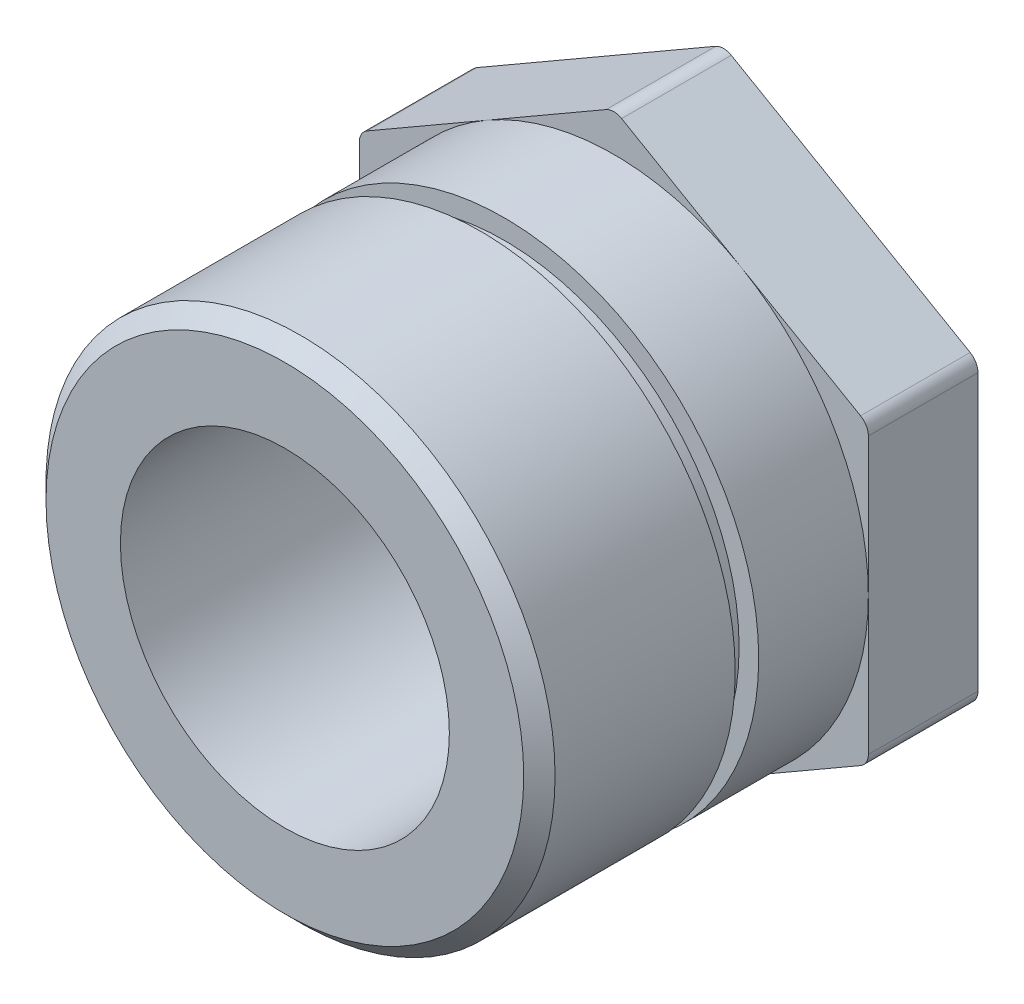
ISO-10303-21;
HEADER;
FILE_DESCRIPTION(('STEP AP214'),'2;1');
FILE_NAME('part.step','',(''),(''),'','','');
FILE_SCHEMA(('AUTOMOTIVE_DESIGN { 1 0 10303 214 1 1 1 1 }'));
ENDSEC;
DATA;
#1=APPLICATION_CONTEXT('core data for automotive mechanical design processes');
#2=APPLICATION_PROTOCOL_DEFINITION('international standard','automotive_design',2000,#1);
#3=PRODUCT_CONTEXT('',#1,'mechanical');
#4=PRODUCT('Part','Part','',(#3));
#5=PRODUCT_RELATED_PRODUCT_CATEGORY('part','',(#4));
#6=PRODUCT_DEFINITION_FORMATION('','',#4);
#7=PRODUCT_DEFINITION_CONTEXT('part definition',#1,'design');
#8=PRODUCT_DEFINITION('design','',#6,#7);
#9=PRODUCT_DEFINITION_SHAPE('','',#8);
#10=(LENGTH_UNIT() NAMED_UNIT(*) SI_UNIT(.MILLI.,.METRE.));
#11=(NAMED_UNIT(*) PLANE_ANGLE_UNIT() SI_UNIT($,.RADIAN.));
#12=(NAMED_UNIT(*) SI_UNIT($,.STERADIAN.) SOLID_ANGLE_UNIT());
#13=UNCERTAINTY_MEASURE_WITH_UNIT(LENGTH_MEASURE(1.E-05),#10,'distance_accuracy_value','');
#14=(GEOMETRIC_REPRESENTATION_CONTEXT(3) GLOBAL_UNCERTAINTY_ASSIGNED_CONTEXT((#13)) GLOBAL_UNIT_ASSIGNED_CONTEXT((#10,
#11,#12)) REPRESENTATION_CONTEXT('',''));
#15=CARTESIAN_POINT('',(0.,0.,0.));
#16=DIRECTION('',(0.,0.,1.));
#17=DIRECTION('',(1.,0.,0.));
#18=AXIS2_PLACEMENT_3D('',#15,#16,#17);
#19=CARTESIAN_POINT('',(0.,0.,42.));
#20=DIRECTION('',(0.,0.,-1.));
#21=DIRECTION('',(-1.,0.,0.));
#22=AXIS2_PLACEMENT_3D('',#19,#20,#21);
#23=CYLINDRICAL_SURFACE('',#22,32.5);
#24=CARTESIAN_POINT('',(0.,0.,40.0000000000001));
#25=DIRECTION('',(0.,0.,1.));
#26=DIRECTION('',(1.,0.,0.));
#27=AXIS2_PLACEMENT_3D('',#24,#25,#26);
#28=CIRCLE('',#27,32.5);
#29=CARTESIAN_POINT('',(32.5,0.,40.0000000000001));
#30=VERTEX_POINT('',#29);
#31=EDGE_CURVE('E11',#30,#30,#28,.F.);
#32=ORIENTED_EDGE('',*,*,#31,.T.);
#33=EDGE_LOOP('',(#32));
#34=FACE_BOUND('',#33,.T.);
#35=CARTESIAN_POINT('',(0.,0.,17.));
#36=DIRECTION('',(0.,0.,1.));
#37=DIRECTION('',(1.,0.,0.));
#38=AXIS2_PLACEMENT_3D('',#35,#36,#37);
#39=CIRCLE('',#38,32.5);
#40=CARTESIAN_POINT('',(32.5,0.,17.));
#41=VERTEX_POINT('',#40);
#42=EDGE_CURVE('E343',#41,#41,#39,.T.);
#43=ORIENTED_EDGE('',*,*,#42,.T.);
#44=EDGE_LOOP('',(#43));
#45=FACE_BOUND('',#44,.T.);
#46=ADVANCED_FACE('F51',(#34,#45),#23,.T.);
#47=CARTESIAN_POINT('',(0.,0.,42.));
#48=DIRECTION('',(0.,0.,1.));
#49=DIRECTION('',(1.,0.,0.));
#50=AXIS2_PLACEMENT_3D('',#47,#48,#49);
#51=PLANE('',#50);
#52=CARTESIAN_POINT('',(0.,0.,42.));
#53=DIRECTION('',(0.,0.,1.));
#54=DIRECTION('',(1.,0.,0.));
#55=AXIS2_PLACEMENT_3D('',#52,#53,#54);
#56=CIRCLE('',#55,21.);
#57=CARTESIAN_POINT('',(21.,0.,42.));
#58=VERTEX_POINT('',#57);
#59=EDGE_CURVE('E403',#58,#58,#56,.T.);
#60=ORIENTED_EDGE('',*,*,#59,.F.);
#61=EDGE_LOOP('',(#60));
#62=FACE_BOUND('',#61,.T.);
#63=CARTESIAN_POINT('',(0.,0.,42.));
#64=DIRECTION('',(0.,0.,1.));
#65=DIRECTION('',(1.,0.,0.));
#66=AXIS2_PLACEMENT_3D('',#63,#64,#65);
#67=CIRCLE('',#66,30.5000000000001);
#68=CARTESIAN_POINT('',(30.5000000000001,0.,42.));
#69=VERTEX_POINT('',#68);
#70=EDGE_CURVE('E61',#69,#69,#67,.T.);
#71=ORIENTED_EDGE('',*,*,#70,.T.);
#72=EDGE_LOOP('',(#71));
#73=FACE_BOUND('',#72,.T.);
#74=ADVANCED_FACE('F286',(#62,#73),#51,.T.);
#75=CARTESIAN_POINT('',(0.,0.,17.));
#76=DIRECTION('',(0.,0.,1.));
#77=DIRECTION('',(1.,0.,0.));
#78=AXIS2_PLACEMENT_3D('',#75,#76,#77);
#79=PLANE('',#78);
#80=ORIENTED_EDGE('',*,*,#42,.F.);
#81=EDGE_LOOP('',(#80));
#82=FACE_BOUND('',#81,.T.);
#83=CARTESIAN_POINT('',(0.,0.,17.));
#84=DIRECTION('',(0.,0.,1.));
#85=DIRECTION('',(1.,0.,0.));
#86=AXIS2_PLACEMENT_3D('',#83,#84,#85);
#87=CIRCLE('',#86,30.);
#88=CARTESIAN_POINT('',(30.,0.,17.));
#89=VERTEX_POINT('',#88);
#90=EDGE_CURVE('E345',#89,#89,#87,.T.);
#91=ORIENTED_EDGE('',*,*,#90,.T.);
#92=EDGE_LOOP('',(#91));
#93=FACE_BOUND('',#92,.T.);
#94=ADVANCED_FACE('F307',(#82,#93),#79,.F.);
#95=CARTESIAN_POINT('',(0.,0.,14.));
#96=DIRECTION('',(0.,0.,1.));
#97=DIRECTION('',(1.,0.,0.));
#98=AXIS2_PLACEMENT_3D('',#95,#96,#97);
#99=PLANE('',#98);
#100=CARTESIAN_POINT('',(0.,0.,14.));
#101=DIRECTION('',(0.,0.,1.));
#102=DIRECTION('',(1.,0.,0.));
#103=AXIS2_PLACEMENT_3D('',#100,#101,#102);
#104=CIRCLE('',#103,32.5);
#105=CARTESIAN_POINT('',(32.5,0.,14.));
#106=VERTEX_POINT('',#105);
#107=EDGE_CURVE('E209',#106,#106,#104,.T.);
#108=ORIENTED_EDGE('',*,*,#107,.T.);
#109=EDGE_LOOP('',(#108));
#110=FACE_BOUND('',#109,.T.);
#111=CARTESIAN_POINT('',(0.,0.,14.));
#112=DIRECTION('',(0.,0.,1.));
#113=DIRECTION('',(1.,0.,0.));
#114=AXIS2_PLACEMENT_3D('',#111,#112,#113);
#115=CIRCLE('',#114,30.);
#116=CARTESIAN_POINT('',(30.,0.,14.));
#117=VERTEX_POINT('',#116);
#118=EDGE_CURVE('E347',#117,#117,#115,.T.);
#119=ORIENTED_EDGE('',*,*,#118,.F.);
#120=EDGE_LOOP('',(#119));
#121=FACE_BOUND('',#120,.T.);
#122=ADVANCED_FACE('F323',(#110,#121),#99,.T.);
#123=CARTESIAN_POINT('',(0.,0.,17.));
#124=DIRECTION('',(0.,0.,-1.));
#125=DIRECTION('',(-1.,0.,0.));
#126=AXIS2_PLACEMENT_3D('',#123,#124,#125);
#127=CYLINDRICAL_SURFACE('',#126,30.);
#128=ORIENTED_EDGE('',*,*,#90,.F.);
#129=EDGE_LOOP('',(#128));
#130=FACE_BOUND('',#129,.T.);
#131=ORIENTED_EDGE('',*,*,#118,.T.);
#132=EDGE_LOOP('',(#131));
#133=FACE_BOUND('',#132,.T.);
#134=ADVANCED_FACE('F314',(#130,#133),#127,.T.);
#135=CARTESIAN_POINT('',(0.,0.,0.));
#136=DIRECTION('',(0.,0.,1.));
#137=DIRECTION('',(1.,0.,0.));
#138=AXIS2_PLACEMENT_3D('',#135,#136,#137);
#139=CIRCLE('',#138,32.5);
#140=CARTESIAN_POINT('',(32.5,0.,0.));
#141=VERTEX_POINT('',#140);
#142=CARTESIAN_POINT('',(16.25,28.1458256229943,0.));
#143=VERTEX_POINT('',#142);
#144=EDGE_CURVE('E204',#141,#143,#139,.T.);
#145=ORIENTED_EDGE('',*,*,#144,.T.);
#146=CARTESIAN_POINT('',(-16.25,28.1458256229943,0.));
#147=VERTEX_POINT('',#146);
#148=EDGE_CURVE('E203',#143,#147,#139,.T.);
#149=ORIENTED_EDGE('',*,*,#148,.T.);
#150=CARTESIAN_POINT('',(-32.5,0.,0.));
#151=VERTEX_POINT('',#150);
#152=EDGE_CURVE('E200',#147,#151,#139,.T.);
#153=ORIENTED_EDGE('',*,*,#152,.T.);
#154=CARTESIAN_POINT('',(-16.25,-28.1458256229943,0.));
#155=VERTEX_POINT('',#154);
#156=EDGE_CURVE('E185',#151,#155,#139,.T.);
#157=ORIENTED_EDGE('',*,*,#156,.T.);
#158=CARTESIAN_POINT('',(16.25,-28.1458256229943,0.));
#159=VERTEX_POINT('',#158);
#160=EDGE_CURVE('E177',#155,#159,#139,.T.);
#161=ORIENTED_EDGE('',*,*,#160,.T.);
#162=EDGE_CURVE('E186',#159,#141,#139,.T.);
#163=ORIENTED_EDGE('',*,*,#162,.T.);
#164=EDGE_LOOP('',(#145,#149,#153,#157,#161,#163));
#165=FACE_BOUND('',#164,.T.);
#166=ORIENTED_EDGE('',*,*,#107,.F.);
#167=EDGE_LOOP('',(#166));
#168=FACE_BOUND('',#167,.T.);
#169=ADVANCED_FACE('F196',(#165,#168),#23,.T.);
#170=CARTESIAN_POINT('',(0.,0.,0.));
#171=DIRECTION('',(0.,0.,-1.));
#172=DIRECTION('',(-1.,0.,0.));
#173=AXIS2_PLACEMENT_3D('',#170,#171,#172);
#174=PLANE('',#173);
#175=DIRECTION('',(0.,-1.,0.));
#176=VECTOR('',#175,1.);
#177=CARTESIAN_POINT('',(32.5,18.7638837486629,0.));
#178=LINE('',#177,#176);
#179=CARTESIAN_POINT('',(32.5,17.6091832102836,0.));
#180=VERTEX_POINT('',#179);
#181=EDGE_CURVE('E370',#180,#141,#178,.T.);
#182=ORIENTED_EDGE('',*,*,#181,.F.);
#183=CARTESIAN_POINT('',(30.5,17.6091832102836,0.));
#184=DIRECTION('',(0.,0.,-1.));
#185=DIRECTION('',(-1.,0.,0.));
#186=AXIS2_PLACEMENT_3D('',#183,#184,#185);
#187=CIRCLE('',#186,2.);
#188=CARTESIAN_POINT('',(31.5,19.3412340178525,0.));
#189=VERTEX_POINT('',#188);
#190=EDGE_CURVE('E253',#180,#189,#187,.F.);
#191=ORIENTED_EDGE('',*,*,#190,.T.);
#192=DIRECTION('',(0.866025403784439,-0.5,0.));
#193=VECTOR('',#192,1.);
#194=CARTESIAN_POINT('',(0.,37.5277674973257,0.));
#195=LINE('',#194,#193);
#196=EDGE_CURVE('E375',#143,#189,#195,.T.);
#197=ORIENTED_EDGE('',*,*,#196,.F.);
#198=ORIENTED_EDGE('',*,*,#144,.F.);
#199=EDGE_LOOP('',(#182,#191,#197,#198));
#200=FACE_BOUND('',#199,.T.);
#201=ADVANCED_FACE('F313',(#200),#174,.F.);
#202=CARTESIAN_POINT('',(1.00000000000001,36.9504172281361,0.));
#203=VERTEX_POINT('',#202);
#204=EDGE_CURVE('E371',#203,#143,#195,.T.);
#205=ORIENTED_EDGE('',*,*,#204,.F.);
#206=CARTESIAN_POINT('',(0.,35.2183664205672,0.));
#207=DIRECTION('',(0.,0.,-1.));
#208=DIRECTION('',(-1.,0.,0.));
#209=AXIS2_PLACEMENT_3D('',#206,#207,#208);
#210=CIRCLE('',#209,2.);
#211=CARTESIAN_POINT('',(-1.,36.9504172281361,0.));
#212=VERTEX_POINT('',#211);
#213=EDGE_CURVE('E280',#203,#212,#210,.F.);
#214=ORIENTED_EDGE('',*,*,#213,.T.);
#215=DIRECTION('',(0.866025403784439,0.5,0.));
#216=VECTOR('',#215,1.);
#217=CARTESIAN_POINT('',(-32.5,18.7638837486628,0.));
#218=LINE('',#217,#216);
#219=EDGE_CURVE('E383',#147,#212,#218,.T.);
#220=ORIENTED_EDGE('',*,*,#219,.F.);
#221=ORIENTED_EDGE('',*,*,#148,.F.);
#222=EDGE_LOOP('',(#205,#214,#220,#221));
#223=FACE_BOUND('',#222,.T.);
#224=ADVANCED_FACE('F319',(#223),#174,.F.);
#225=CARTESIAN_POINT('',(-31.5,19.3412340178525,0.));
#226=VERTEX_POINT('',#225);
#227=EDGE_CURVE('E379',#226,#147,#218,.T.);
#228=ORIENTED_EDGE('',*,*,#227,.F.);
#229=CARTESIAN_POINT('',(-30.5,17.6091832102836,0.));
#230=DIRECTION('',(0.,0.,-1.));
#231=DIRECTION('',(-1.,0.,0.));
#232=AXIS2_PLACEMENT_3D('',#229,#230,#231);
#233=CIRCLE('',#232,2.);
#234=CARTESIAN_POINT('',(-32.5,17.6091832102836,0.));
#235=VERTEX_POINT('',#234);
#236=EDGE_CURVE('E76',#226,#235,#233,.F.);
#237=ORIENTED_EDGE('',*,*,#236,.T.);
#238=DIRECTION('',(0.,1.,0.));
#239=VECTOR('',#238,1.);
#240=CARTESIAN_POINT('',(-32.5,-18.7638837486628,0.));
#241=LINE('',#240,#239);
#242=EDGE_CURVE('E173',#151,#235,#241,.T.);
#243=ORIENTED_EDGE('',*,*,#242,.F.);
#244=ORIENTED_EDGE('',*,*,#152,.F.);
#245=EDGE_LOOP('',(#228,#237,#243,#244));
#246=FACE_BOUND('',#245,.T.);
#247=ADVANCED_FACE('F483',(#246),#174,.F.);
#248=CARTESIAN_POINT('',(-32.5,-17.6091832102836,0.));
#249=VERTEX_POINT('',#248);
#250=EDGE_CURVE('E419',#249,#151,#241,.T.);
#251=ORIENTED_EDGE('',*,*,#250,.F.);
#252=CARTESIAN_POINT('',(-30.5,-17.6091832102836,0.));
#253=DIRECTION('',(0.,0.,-1.));
#254=DIRECTION('',(-1.,0.,0.));
#255=AXIS2_PLACEMENT_3D('',#252,#253,#254);
#256=CIRCLE('',#255,2.);
#257=CARTESIAN_POINT('',(-31.5,-19.3412340178525,0.));
#258=VERTEX_POINT('',#257);
#259=EDGE_CURVE('E68',#249,#258,#256,.F.);
#260=ORIENTED_EDGE('',*,*,#259,.T.);
#261=DIRECTION('',(-0.866025403784439,0.5,0.));
#262=VECTOR('',#261,1.);
#263=CARTESIAN_POINT('',(0.,-37.5277674973257,0.));
#264=LINE('',#263,#262);
#265=EDGE_CURVE('E168',#155,#258,#264,.T.);
#266=ORIENTED_EDGE('',*,*,#265,.F.);
#267=ORIENTED_EDGE('',*,*,#156,.F.);
#268=EDGE_LOOP('',(#251,#260,#266,#267));
#269=FACE_BOUND('',#268,.T.);
#270=ADVANCED_FACE('F191',(#269),#174,.F.);
#271=CARTESIAN_POINT('',(-1.,-36.9504172281361,0.));
#272=VERTEX_POINT('',#271);
#273=EDGE_CURVE('E163',#272,#155,#264,.T.);
#274=ORIENTED_EDGE('',*,*,#273,.F.);
#275=CARTESIAN_POINT('',(0.,-35.2183664205672,0.));
#276=DIRECTION('',(0.,0.,-1.));
#277=DIRECTION('',(-1.,0.,0.));
#278=AXIS2_PLACEMENT_3D('',#275,#276,#277);
#279=CIRCLE('',#278,2.);
#280=CARTESIAN_POINT('',(1.,-36.9504172281361,0.));
#281=VERTEX_POINT('',#280);
#282=EDGE_CURVE('E215',#272,#281,#279,.F.);
#283=ORIENTED_EDGE('',*,*,#282,.T.);
#284=DIRECTION('',(-0.866025403784439,-0.5,0.));
#285=VECTOR('',#284,1.);
#286=CARTESIAN_POINT('',(32.5,-18.7638837486628,0.));
#287=LINE('',#286,#285);
#288=EDGE_CURVE('E180',#159,#281,#287,.T.);
#289=ORIENTED_EDGE('',*,*,#288,.F.);
#290=ORIENTED_EDGE('',*,*,#160,.F.);
#291=EDGE_LOOP('',(#274,#283,#289,#290));
#292=FACE_BOUND('',#291,.T.);
#293=ADVANCED_FACE('F178',(#292),#174,.F.);
#294=CARTESIAN_POINT('',(0.,-37.5277674973257,-14.));
#295=DIRECTION('',(0.5,0.866025403784439,0.));
#296=DIRECTION('',(-0.866025403784439,0.5,0.));
#297=AXIS2_PLACEMENT_3D('',#294,#295,#296);
#298=PLANE('',#297);
#299=DIRECTION('',(-0.866025403784439,0.5,0.));
#300=VECTOR('',#299,1.);
#301=CARTESIAN_POINT('',(0.,-37.5277674973257,-14.));
#302=LINE('',#301,#300);
#303=CARTESIAN_POINT('',(-1.,-36.9504172281361,-14.));
#304=VERTEX_POINT('',#303);
#305=CARTESIAN_POINT('',(-31.5,-19.3412340178525,-14.));
#306=VERTEX_POINT('',#305);
#307=EDGE_CURVE('E391',#304,#306,#302,.T.);
#308=ORIENTED_EDGE('',*,*,#307,.F.);
#309=DIRECTION('',(0.,0.,1.));
#310=VECTOR('',#309,1.);
#311=CARTESIAN_POINT('',(-1.,-36.9504172281361,-14.));
#312=LINE('',#311,#310);
#313=EDGE_CURVE('E170',#304,#272,#312,.T.);
#314=ORIENTED_EDGE('',*,*,#313,.T.);
#315=ORIENTED_EDGE('',*,*,#273,.T.);
#316=ORIENTED_EDGE('',*,*,#265,.T.);
#317=DIRECTION('',(0.,0.,1.));
#318=VECTOR('',#317,1.);
#319=CARTESIAN_POINT('',(-31.5,-19.3412340178525,-14.));
#320=LINE('',#319,#318);
#321=EDGE_CURVE('E208',#258,#306,#320,.F.);
#322=ORIENTED_EDGE('',*,*,#321,.T.);
#323=EDGE_LOOP('',(#308,#314,#315,#316,#322));
#324=FACE_BOUND('',#323,.T.);
#325=ADVANCED_FACE('F166',(#324),#298,.F.);
#326=CARTESIAN_POINT('',(-32.5,-18.7638837486628,-14.));
#327=DIRECTION('',(1.,0.,0.));
#328=DIRECTION('',(0.,1.,0.));
#329=AXIS2_PLACEMENT_3D('',#326,#327,#328);
#330=PLANE('',#329);
#331=ORIENTED_EDGE('',*,*,#242,.T.);
#332=DIRECTION('',(0.,0.,1.));
#333=VECTOR('',#332,1.);
#334=CARTESIAN_POINT('',(-32.5,17.6091832102836,-14.));
#335=LINE('',#334,#333);
#336=CARTESIAN_POINT('',(-32.5,17.6091832102836,-14.));
#337=VERTEX_POINT('',#336);
#338=EDGE_CURVE('E275',#235,#337,#335,.F.);
#339=ORIENTED_EDGE('',*,*,#338,.T.);
#340=DIRECTION('',(0.,1.,0.));
#341=VECTOR('',#340,1.);
#342=CARTESIAN_POINT('',(-32.5,-18.7638837486628,-14.));
#343=LINE('',#342,#341);
#344=CARTESIAN_POINT('',(-32.5,-17.6091832102836,-14.));
#345=VERTEX_POINT('',#344);
#346=EDGE_CURVE('E394',#345,#337,#343,.T.);
#347=ORIENTED_EDGE('',*,*,#346,.F.);
#348=DIRECTION('',(0.,0.,1.));
#349=VECTOR('',#348,1.);
#350=CARTESIAN_POINT('',(-32.5,-17.6091832102836,-14.));
#351=LINE('',#350,#349);
#352=EDGE_CURVE('E272',#345,#249,#351,.T.);
#353=ORIENTED_EDGE('',*,*,#352,.T.);
#354=ORIENTED_EDGE('',*,*,#250,.T.);
#355=EDGE_LOOP('',(#331,#339,#347,#353,#354));
#356=FACE_BOUND('',#355,.T.);
#357=ADVANCED_FACE('F426',(#356),#330,.F.);
#358=CARTESIAN_POINT('',(-32.5,18.7638837486628,-14.));
#359=DIRECTION('',(0.5,-0.866025403784439,0.));
#360=DIRECTION('',(0.866025403784439,0.5,0.));
#361=AXIS2_PLACEMENT_3D('',#358,#359,#360);
#362=PLANE('',#361);
#363=DIRECTION('',(0.866025403784439,0.5,0.));
#364=VECTOR('',#363,1.);
#365=CARTESIAN_POINT('',(-32.5,18.7638837486628,-14.));
#366=LINE('',#365,#364);
#367=CARTESIAN_POINT('',(-31.5,19.3412340178525,-14.));
#368=VERTEX_POINT('',#367);
#369=CARTESIAN_POINT('',(-1.,36.9504172281361,-14.));
#370=VERTEX_POINT('',#369);
#371=EDGE_CURVE('E400',#368,#370,#366,.T.);
#372=ORIENTED_EDGE('',*,*,#371,.F.);
#373=DIRECTION('',(0.,0.,1.));
#374=VECTOR('',#373,1.);
#375=CARTESIAN_POINT('',(-31.5,19.3412340178525,-14.));
#376=LINE('',#375,#374);
#377=EDGE_CURVE('E266',#368,#226,#376,.T.);
#378=ORIENTED_EDGE('',*,*,#377,.T.);
#379=ORIENTED_EDGE('',*,*,#227,.T.);
#380=ORIENTED_EDGE('',*,*,#219,.T.);
#381=DIRECTION('',(0.,0.,1.));
#382=VECTOR('',#381,1.);
#383=CARTESIAN_POINT('',(-0.999999999999987,36.9504172281361,-14.));
#384=LINE('',#383,#382);
#385=EDGE_CURVE('E263',#212,#370,#384,.F.);
#386=ORIENTED_EDGE('',*,*,#385,.T.);
#387=EDGE_LOOP('',(#372,#378,#379,#380,#386));
#388=FACE_BOUND('',#387,.T.);
#389=ADVANCED_FACE('F436',(#388),#362,.F.);
#390=CARTESIAN_POINT('',(0.,37.5277674973257,-14.));
#391=DIRECTION('',(-0.5,-0.866025403784439,0.));
#392=DIRECTION('',(0.866025403784439,-0.5,0.));
#393=AXIS2_PLACEMENT_3D('',#390,#391,#392);
#394=PLANE('',#393);
#395=ORIENTED_EDGE('',*,*,#196,.T.);
#396=DIRECTION('',(0.,0.,1.));
#397=VECTOR('',#396,1.);
#398=CARTESIAN_POINT('',(31.5,19.3412340178525,-14.));
#399=LINE('',#398,#397);
#400=CARTESIAN_POINT('',(31.5,19.3412340178525,-14.));
#401=VERTEX_POINT('',#400);
#402=EDGE_CURVE('E260',#189,#401,#399,.F.);
#403=ORIENTED_EDGE('',*,*,#402,.T.);
#404=DIRECTION('',(0.866025403784439,-0.5,0.));
#405=VECTOR('',#404,1.);
#406=CARTESIAN_POINT('',(0.,37.5277674973257,-14.));
#407=LINE('',#406,#405);
#408=CARTESIAN_POINT('',(1.00000000000001,36.9504172281361,-14.));
#409=VERTEX_POINT('',#408);
#410=EDGE_CURVE('E409',#409,#401,#407,.T.);
#411=ORIENTED_EDGE('',*,*,#410,.F.);
#412=DIRECTION('',(0.,0.,1.));
#413=VECTOR('',#412,1.);
#414=CARTESIAN_POINT('',(1.00000000000001,36.9504172281361,-14.));
#415=LINE('',#414,#413);
#416=EDGE_CURVE('E256',#409,#203,#415,.T.);
#417=ORIENTED_EDGE('',*,*,#416,.T.);
#418=ORIENTED_EDGE('',*,*,#204,.T.);
#419=EDGE_LOOP('',(#395,#403,#411,#417,#418));
#420=FACE_BOUND('',#419,.T.);
#421=ADVANCED_FACE('F442',(#420),#394,.F.);
#422=CARTESIAN_POINT('',(32.5,18.7638837486629,-14.));
#423=DIRECTION('',(-1.,0.,0.));
#424=DIRECTION('',(0.,0.,1.));
#425=AXIS2_PLACEMENT_3D('',#422,#423,#424);
#426=PLANE('',#425);
#427=CARTESIAN_POINT('',(32.5,-17.6091832102836,0.));
#428=VERTEX_POINT('',#427);
#429=EDGE_CURVE('E366',#141,#428,#178,.T.);
#430=ORIENTED_EDGE('',*,*,#429,.T.);
#431=DIRECTION('',(0.,0.,1.));
#432=VECTOR('',#431,1.);
#433=CARTESIAN_POINT('',(32.5,-17.6091832102836,-14.));
#434=LINE('',#433,#432);
#435=CARTESIAN_POINT('',(32.5,-17.6091832102836,-14.));
#436=VERTEX_POINT('',#435);
#437=EDGE_CURVE('E250',#428,#436,#434,.F.);
#438=ORIENTED_EDGE('',*,*,#437,.T.);
#439=DIRECTION('',(0.,-1.,0.));
#440=VECTOR('',#439,1.);
#441=CARTESIAN_POINT('',(32.5,18.7638837486629,-14.));
#442=LINE('',#441,#440);
#443=CARTESIAN_POINT('',(32.5,17.6091832102836,-14.));
#444=VERTEX_POINT('',#443);
#445=EDGE_CURVE('E413',#444,#436,#442,.T.);
#446=ORIENTED_EDGE('',*,*,#445,.F.);
#447=DIRECTION('',(0.,0.,1.));
#448=VECTOR('',#447,1.);
#449=CARTESIAN_POINT('',(32.5,17.6091832102836,-14.));
#450=LINE('',#449,#448);
#451=EDGE_CURVE('E246',#444,#180,#450,.T.);
#452=ORIENTED_EDGE('',*,*,#451,.T.);
#453=ORIENTED_EDGE('',*,*,#181,.T.);
#454=EDGE_LOOP('',(#430,#438,#446,#452,#453));
#455=FACE_BOUND('',#454,.T.);
#456=ADVANCED_FACE('F449',(#455),#426,.F.);
#457=CARTESIAN_POINT('',(32.5,-18.7638837486628,-14.));
#458=DIRECTION('',(-0.5,0.866025403784439,0.));
#459=DIRECTION('',(-0.866025403784439,-0.5,0.));
#460=AXIS2_PLACEMENT_3D('',#457,#458,#459);
#461=PLANE('',#460);
#462=ORIENTED_EDGE('',*,*,#288,.T.);
#463=DIRECTION('',(0.,0.,1.));
#464=VECTOR('',#463,1.);
#465=CARTESIAN_POINT('',(1.,-36.9504172281361,-14.));
#466=LINE('',#465,#464);
#467=CARTESIAN_POINT('',(1.,-36.9504172281361,-14.));
#468=VERTEX_POINT('',#467);
#469=EDGE_CURVE('E222',#281,#468,#466,.F.);
#470=ORIENTED_EDGE('',*,*,#469,.T.);
#471=DIRECTION('',(-0.866025403784439,-0.5,0.));
#472=VECTOR('',#471,1.);
#473=CARTESIAN_POINT('',(32.5,-18.7638837486628,-14.));
#474=LINE('',#473,#472);
#475=CARTESIAN_POINT('',(31.5,-19.3412340178525,-14.));
#476=VERTEX_POINT('',#475);
#477=EDGE_CURVE('E353',#476,#468,#474,.T.);
#478=ORIENTED_EDGE('',*,*,#477,.F.);
#479=DIRECTION('',(0.,0.,1.));
#480=VECTOR('',#479,1.);
#481=CARTESIAN_POINT('',(31.5,-19.3412340178525,-14.));
#482=LINE('',#481,#480);
#483=CARTESIAN_POINT('',(31.5,-19.3412340178525,0.));
#484=VERTEX_POINT('',#483);
#485=EDGE_CURVE('E218',#476,#484,#482,.T.);
#486=ORIENTED_EDGE('',*,*,#485,.T.);
#487=EDGE_CURVE('E356',#484,#159,#287,.T.);
#488=ORIENTED_EDGE('',*,*,#487,.T.);
#489=EDGE_LOOP('',(#462,#470,#478,#486,#488));
#490=FACE_BOUND('',#489,.T.);
#491=ADVANCED_FACE('F455',(#490),#461,.F.);
#492=CARTESIAN_POINT('',(0.,0.,-14.));
#493=DIRECTION('',(0.,0.,-1.));
#494=DIRECTION('',(-1.,0.,0.));
#495=AXIS2_PLACEMENT_3D('',#492,#493,#494);
#496=PLANE('',#495);
#497=CARTESIAN_POINT('',(0.,0.,-14.));
#498=DIRECTION('',(0.,0.,1.));
#499=DIRECTION('',(1.,0.,0.));
#500=AXIS2_PLACEMENT_3D('',#497,#498,#499);
#501=CIRCLE('',#500,21.);
#502=CARTESIAN_POINT('',(21.,0.,-14.));
#503=VERTEX_POINT('',#502);
#504=EDGE_CURVE('E193',#503,#503,#501,.T.);
#505=ORIENTED_EDGE('',*,*,#504,.T.);
#506=EDGE_LOOP('',(#505));
#507=FACE_BOUND('',#506,.T.);
#508=ORIENTED_EDGE('',*,*,#477,.T.);
#509=CARTESIAN_POINT('',(0.,-35.2183664205672,-14.));
#510=DIRECTION('',(0.,0.,-1.));
#511=DIRECTION('',(-1.,0.,0.));
#512=AXIS2_PLACEMENT_3D('',#509,#510,#511);
#513=CIRCLE('',#512,2.);
#514=EDGE_CURVE('E240',#468,#304,#513,.T.);
#515=ORIENTED_EDGE('',*,*,#514,.T.);
#516=ORIENTED_EDGE('',*,*,#307,.T.);
#517=CARTESIAN_POINT('',(-30.5,-17.6091832102836,-14.));
#518=DIRECTION('',(0.,0.,-1.));
#519=DIRECTION('',(-1.,0.,0.));
#520=AXIS2_PLACEMENT_3D('',#517,#518,#519);
#521=CIRCLE('',#520,2.);
#522=EDGE_CURVE('E228',#306,#345,#521,.T.);
#523=ORIENTED_EDGE('',*,*,#522,.T.);
#524=ORIENTED_EDGE('',*,*,#346,.T.);
#525=CARTESIAN_POINT('',(-30.5,17.6091832102836,-14.));
#526=DIRECTION('',(0.,0.,-1.));
#527=DIRECTION('',(-1.,0.,0.));
#528=AXIS2_PLACEMENT_3D('',#525,#526,#527);
#529=CIRCLE('',#528,2.);
#530=EDGE_CURVE('E231',#337,#368,#529,.T.);
#531=ORIENTED_EDGE('',*,*,#530,.T.);
#532=ORIENTED_EDGE('',*,*,#371,.T.);
#533=CARTESIAN_POINT('',(0.,35.2183664205672,-14.));
#534=DIRECTION('',(0.,0.,-1.));
#535=DIRECTION('',(-1.,0.,0.));
#536=AXIS2_PLACEMENT_3D('',#533,#534,#535);
#537=CIRCLE('',#536,2.);
#538=EDGE_CURVE('E225',#370,#409,#537,.T.);
#539=ORIENTED_EDGE('',*,*,#538,.T.);
#540=ORIENTED_EDGE('',*,*,#410,.T.);
#541=CARTESIAN_POINT('',(30.5,17.6091832102836,-14.));
#542=DIRECTION('',(0.,0.,-1.));
#543=DIRECTION('',(-1.,0.,0.));
#544=AXIS2_PLACEMENT_3D('',#541,#542,#543);
#545=CIRCLE('',#544,2.);
#546=EDGE_CURVE('E234',#401,#444,#545,.T.);
#547=ORIENTED_EDGE('',*,*,#546,.T.);
#548=ORIENTED_EDGE('',*,*,#445,.T.);
#549=CARTESIAN_POINT('',(30.5,-17.6091832102836,-14.));
#550=DIRECTION('',(0.,0.,-1.));
#551=DIRECTION('',(-1.,0.,0.));
#552=AXIS2_PLACEMENT_3D('',#549,#550,#551);
#553=CIRCLE('',#552,2.);
#554=EDGE_CURVE('E237',#436,#476,#553,.T.);
#555=ORIENTED_EDGE('',*,*,#554,.T.);
#556=EDGE_LOOP('',(#508,#515,#516,#523,#524,#531,#532,#539,#540,#547,#548,#555));
#557=FACE_BOUND('',#556,.T.);
#558=ADVANCED_FACE('F433',(#507,#557),#496,.T.);
#559=ORIENTED_EDGE('',*,*,#487,.F.);
#560=CARTESIAN_POINT('',(30.5,-17.6091832102836,0.));
#561=DIRECTION('',(0.,0.,-1.));
#562=DIRECTION('',(-1.,0.,0.));
#563=AXIS2_PLACEMENT_3D('',#560,#561,#562);
#564=CIRCLE('',#563,2.);
#565=EDGE_CURVE('E243',#484,#428,#564,.F.);
#566=ORIENTED_EDGE('',*,*,#565,.T.);
#567=ORIENTED_EDGE('',*,*,#429,.F.);
#568=ORIENTED_EDGE('',*,*,#162,.F.);
#569=EDGE_LOOP('',(#559,#566,#567,#568));
#570=FACE_BOUND('',#569,.T.);
#571=ADVANCED_FACE('F322',(#570),#174,.F.);
#572=CARTESIAN_POINT('',(0.,-35.2183664205672,-14.));
#573=DIRECTION('',(0.,0.,1.));
#574=DIRECTION('',(1.,0.,0.));
#575=AXIS2_PLACEMENT_3D('',#572,#573,#574);
#576=CYLINDRICAL_SURFACE('',#575,2.);
#577=ORIENTED_EDGE('',*,*,#514,.F.);
#578=ORIENTED_EDGE('',*,*,#469,.F.);
#579=ORIENTED_EDGE('',*,*,#282,.F.);
#580=ORIENTED_EDGE('',*,*,#313,.F.);
#581=EDGE_LOOP('',(#577,#578,#579,#580));
#582=FACE_BOUND('',#581,.T.);
#583=ADVANCED_FACE('F457',(#582),#576,.T.);
#584=CARTESIAN_POINT('',(30.5,-17.6091832102836,-14.));
#585=DIRECTION('',(0.,0.,1.));
#586=DIRECTION('',(1.,0.,0.));
#587=AXIS2_PLACEMENT_3D('',#584,#585,#586);
#588=CYLINDRICAL_SURFACE('',#587,2.);
#589=ORIENTED_EDGE('',*,*,#554,.F.);
#590=ORIENTED_EDGE('',*,*,#437,.F.);
#591=ORIENTED_EDGE('',*,*,#565,.F.);
#592=ORIENTED_EDGE('',*,*,#485,.F.);
#593=EDGE_LOOP('',(#589,#590,#591,#592));
#594=FACE_BOUND('',#593,.T.);
#595=ADVANCED_FACE('F451',(#594),#588,.T.);
#596=CARTESIAN_POINT('',(30.5,17.6091832102836,-14.));
#597=DIRECTION('',(0.,0.,1.));
#598=DIRECTION('',(1.,0.,0.));
#599=AXIS2_PLACEMENT_3D('',#596,#597,#598);
#600=CYLINDRICAL_SURFACE('',#599,2.);
#601=ORIENTED_EDGE('',*,*,#546,.F.);
#602=ORIENTED_EDGE('',*,*,#402,.F.);
#603=ORIENTED_EDGE('',*,*,#190,.F.);
#604=ORIENTED_EDGE('',*,*,#451,.F.);
#605=EDGE_LOOP('',(#601,#602,#603,#604));
#606=FACE_BOUND('',#605,.T.);
#607=ADVANCED_FACE('F445',(#606),#600,.T.);
#608=CARTESIAN_POINT('',(-30.5,17.6091832102836,-14.));
#609=DIRECTION('',(0.,0.,1.));
#610=DIRECTION('',(1.,0.,0.));
#611=AXIS2_PLACEMENT_3D('',#608,#609,#610);
#612=CYLINDRICAL_SURFACE('',#611,2.);
#613=ORIENTED_EDGE('',*,*,#530,.F.);
#614=ORIENTED_EDGE('',*,*,#338,.F.);
#615=ORIENTED_EDGE('',*,*,#236,.F.);
#616=ORIENTED_EDGE('',*,*,#377,.F.);
#617=EDGE_LOOP('',(#613,#614,#615,#616));
#618=FACE_BOUND('',#617,.T.);
#619=ADVANCED_FACE('F430',(#618),#612,.T.);
#620=CARTESIAN_POINT('',(-30.5,-17.6091832102836,-14.));
#621=DIRECTION('',(0.,0.,1.));
#622=DIRECTION('',(1.,0.,0.));
#623=AXIS2_PLACEMENT_3D('',#620,#621,#622);
#624=CYLINDRICAL_SURFACE('',#623,2.);
#625=ORIENTED_EDGE('',*,*,#522,.F.);
#626=ORIENTED_EDGE('',*,*,#321,.F.);
#627=ORIENTED_EDGE('',*,*,#259,.F.);
#628=ORIENTED_EDGE('',*,*,#352,.F.);
#629=EDGE_LOOP('',(#625,#626,#627,#628));
#630=FACE_BOUND('',#629,.T.);
#631=ADVANCED_FACE('F298',(#630),#624,.T.);
#632=CARTESIAN_POINT('',(0.,35.2183664205672,-14.));
#633=DIRECTION('',(0.,0.,1.));
#634=DIRECTION('',(1.,0.,0.));
#635=AXIS2_PLACEMENT_3D('',#632,#633,#634);
#636=CYLINDRICAL_SURFACE('',#635,2.);
#637=ORIENTED_EDGE('',*,*,#538,.F.);
#638=ORIENTED_EDGE('',*,*,#385,.F.);
#639=ORIENTED_EDGE('',*,*,#213,.F.);
#640=ORIENTED_EDGE('',*,*,#416,.F.);
#641=EDGE_LOOP('',(#637,#638,#639,#640));
#642=FACE_BOUND('',#641,.T.);
#643=ADVANCED_FACE('F290',(#642),#636,.T.);
#644=CARTESIAN_POINT('',(0.,0.,42.));
#645=DIRECTION('',(0.,0.,-1.));
#646=DIRECTION('',(-1.,0.,0.));
#647=AXIS2_PLACEMENT_3D('',#644,#645,#646);
#648=CONICAL_SURFACE('',#647,30.5000000000001,0.785398163397443);
#649=ORIENTED_EDGE('',*,*,#31,.F.);
#650=EDGE_LOOP('',(#649));
#651=FACE_BOUND('',#650,.T.);
#652=ORIENTED_EDGE('',*,*,#70,.F.);
#653=EDGE_LOOP('',(#652));
#654=FACE_BOUND('',#653,.T.);
#655=ADVANCED_FACE('F54',(#651,#654),#648,.T.);
#656=CARTESIAN_POINT('',(0.,0.,-14.));
#657=DIRECTION('',(0.,0.,1.));
#658=DIRECTION('',(1.,0.,0.));
#659=AXIS2_PLACEMENT_3D('',#656,#657,#658);
#660=CYLINDRICAL_SURFACE('',#659,21.);
#661=ORIENTED_EDGE('',*,*,#504,.F.);
#662=EDGE_LOOP('',(#661));
#663=FACE_BOUND('',#662,.T.);
#664=ORIENTED_EDGE('',*,*,#59,.T.);
#665=EDGE_LOOP('',(#664));
#666=FACE_BOUND('',#665,.T.);
#667=ADVANCED_FACE('F289',(#663,#666),#660,.F.);
#668=CLOSED_SHELL('',(#46,#74,#94,#122,#134,#169,#201,#224,#247,#270,#293,#325,#357,#389,#421,
#456,#491,#558,#571,#583,#595,#607,#619,#631,#643,#655,#667));
#669=MANIFOLD_SOLID_BREP('B2',#668);
#670=ADVANCED_BREP_SHAPE_REPRESENTATION('',(#18,#669),#14);
#671=SHAPE_DEFINITION_REPRESENTATION(#9,#670);
ENDSEC;
END-ISO-10303-21;
